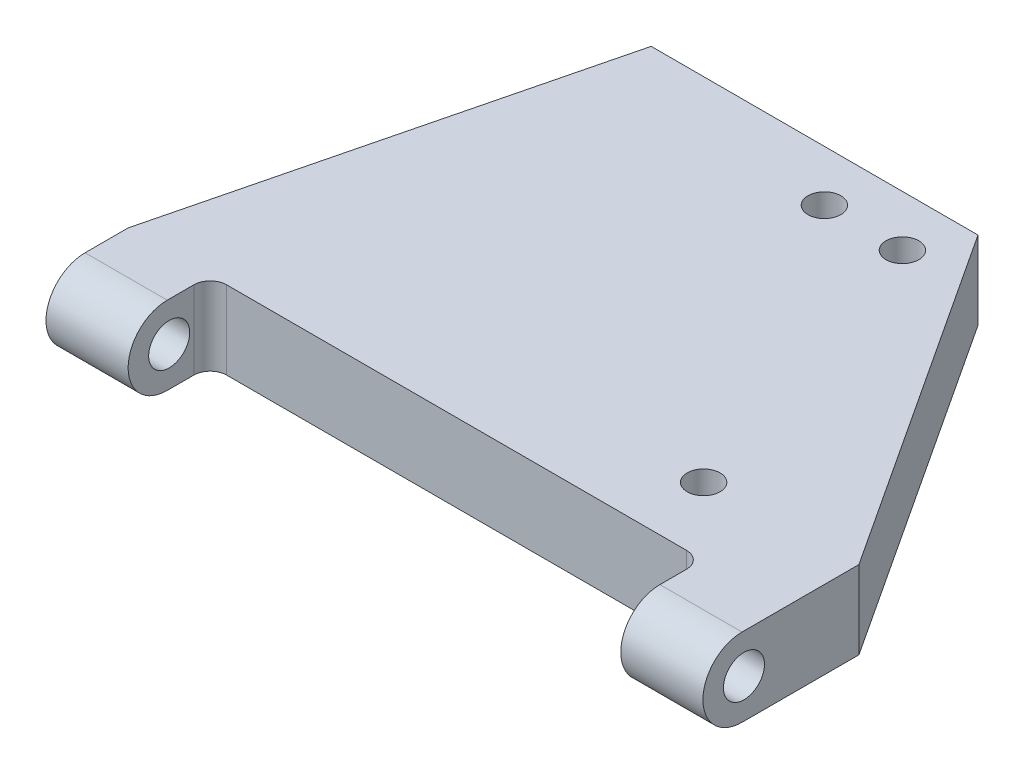
ISO-10303-21;
HEADER;
FILE_DESCRIPTION(('STEP AP214'),'2;1');
FILE_NAME('part.step','',(''),(''),'','','');
FILE_SCHEMA(('AUTOMOTIVE_DESIGN { 1 0 10303 214 1 1 1 1 }'));
ENDSEC;
DATA;
#1=APPLICATION_CONTEXT('core data for automotive mechanical design processes');
#2=APPLICATION_PROTOCOL_DEFINITION('international standard','automotive_design',2000,#1);
#3=PRODUCT_CONTEXT('',#1,'mechanical');
#4=PRODUCT('Part','Part','',(#3));
#5=PRODUCT_RELATED_PRODUCT_CATEGORY('part','',(#4));
#6=PRODUCT_DEFINITION_FORMATION('','',#4);
#7=PRODUCT_DEFINITION_CONTEXT('part definition',#1,'design');
#8=PRODUCT_DEFINITION('design','',#6,#7);
#9=PRODUCT_DEFINITION_SHAPE('','',#8);
#10=(LENGTH_UNIT() NAMED_UNIT(*) SI_UNIT(.MILLI.,.METRE.));
#11=(NAMED_UNIT(*) PLANE_ANGLE_UNIT() SI_UNIT($,.RADIAN.));
#12=(NAMED_UNIT(*) SI_UNIT($,.STERADIAN.) SOLID_ANGLE_UNIT());
#13=UNCERTAINTY_MEASURE_WITH_UNIT(LENGTH_MEASURE(1.E-05),#10,'distance_accuracy_value','');
#14=(GEOMETRIC_REPRESENTATION_CONTEXT(3) GLOBAL_UNCERTAINTY_ASSIGNED_CONTEXT((#13)) GLOBAL_UNIT_ASSIGNED_CONTEXT((#10,
#11,#12)) REPRESENTATION_CONTEXT('',''));
#15=CARTESIAN_POINT('',(0.,0.,0.));
#16=DIRECTION('',(0.,0.,1.));
#17=DIRECTION('',(1.,0.,0.));
#18=AXIS2_PLACEMENT_3D('',#15,#16,#17);
#19=CARTESIAN_POINT('',(140.,9.525,112.475));
#20=DIRECTION('',(1.,0.,0.));
#21=DIRECTION('',(0.,0.,-1.));
#22=AXIS2_PLACEMENT_3D('',#19,#20,#21);
#23=CYLINDRICAL_SURFACE('',#22,9.525);
#24=DIRECTION('',(-1.,0.,0.));
#25=VECTOR('',#24,1.);
#26=CARTESIAN_POINT('',(140.,19.05,112.475));
#27=LINE('',#26,#25);
#28=CARTESIAN_POINT('',(140.,19.05,112.475));
#29=VERTEX_POINT('',#28);
#30=CARTESIAN_POINT('',(160.,19.05,112.475));
#31=VERTEX_POINT('',#30);
#32=EDGE_CURVE('E293',#29,#31,#27,.F.);
#33=ORIENTED_EDGE('',*,*,#32,.F.);
#34=CARTESIAN_POINT('',(140.,9.525,112.475));
#35=DIRECTION('',(1.,0.,0.));
#36=DIRECTION('',(0.,0.,-1.));
#37=AXIS2_PLACEMENT_3D('',#34,#35,#36);
#38=CIRCLE('',#37,9.525);
#39=CARTESIAN_POINT('',(140.,0.,112.475));
#40=VERTEX_POINT('',#39);
#41=EDGE_CURVE('E118',#40,#29,#38,.F.);
#42=ORIENTED_EDGE('',*,*,#41,.F.);
#43=DIRECTION('',(1.,0.,0.));
#44=VECTOR('',#43,1.);
#45=CARTESIAN_POINT('',(0.,0.,112.475));
#46=LINE('',#45,#44);
#47=CARTESIAN_POINT('',(160.,0.,112.475));
#48=VERTEX_POINT('',#47);
#49=EDGE_CURVE('E296',#48,#40,#46,.F.);
#50=ORIENTED_EDGE('',*,*,#49,.F.);
#51=CARTESIAN_POINT('',(160.,9.525,112.475));
#52=DIRECTION('',(-1.,0.,0.));
#53=DIRECTION('',(0.,0.,1.));
#54=AXIS2_PLACEMENT_3D('',#51,#52,#53);
#55=CIRCLE('',#54,9.525);
#56=EDGE_CURVE('E12',#31,#48,#55,.F.);
#57=ORIENTED_EDGE('',*,*,#56,.F.);
#58=EDGE_LOOP('',(#33,#42,#50,#57));
#59=FACE_BOUND('',#58,.T.);
#60=ADVANCED_FACE('F110',(#59),#23,.T.);
#61=CARTESIAN_POINT('',(0.,9.525,112.475));
#62=DIRECTION('',(1.,0.,0.));
#63=DIRECTION('',(0.,0.,-1.));
#64=AXIS2_PLACEMENT_3D('',#61,#62,#63);
#65=CYLINDRICAL_SURFACE('',#64,9.525);
#66=DIRECTION('',(-1.,0.,0.));
#67=VECTOR('',#66,1.);
#68=CARTESIAN_POINT('',(0.,19.05,112.475));
#69=LINE('',#68,#67);
#70=CARTESIAN_POINT('',(0.,19.05,112.475));
#71=VERTEX_POINT('',#70);
#72=CARTESIAN_POINT('',(20.,19.05,112.475));
#73=VERTEX_POINT('',#72);
#74=EDGE_CURVE('E207',#71,#73,#69,.F.);
#75=ORIENTED_EDGE('',*,*,#74,.F.);
#76=CARTESIAN_POINT('',(0.,9.525,112.475));
#77=DIRECTION('',(1.,0.,0.));
#78=DIRECTION('',(0.,0.,-1.));
#79=AXIS2_PLACEMENT_3D('',#76,#77,#78);
#80=CIRCLE('',#79,9.525);
#81=CARTESIAN_POINT('',(0.,0.,112.475));
#82=VERTEX_POINT('',#81);
#83=EDGE_CURVE('E289',#82,#71,#80,.F.);
#84=ORIENTED_EDGE('',*,*,#83,.F.);
#85=DIRECTION('',(1.,0.,0.));
#86=VECTOR('',#85,1.);
#87=CARTESIAN_POINT('',(0.,0.,112.475));
#88=LINE('',#87,#86);
#89=CARTESIAN_POINT('',(20.,0.,112.475));
#90=VERTEX_POINT('',#89);
#91=EDGE_CURVE('E286',#90,#82,#88,.F.);
#92=ORIENTED_EDGE('',*,*,#91,.F.);
#93=CARTESIAN_POINT('',(20.,9.525,112.475));
#94=DIRECTION('',(1.,0.,0.));
#95=DIRECTION('',(0.,0.,-1.));
#96=AXIS2_PLACEMENT_3D('',#93,#94,#95);
#97=CIRCLE('',#96,9.525);
#98=EDGE_CURVE('E291',#73,#90,#97,.T.);
#99=ORIENTED_EDGE('',*,*,#98,.F.);
#100=EDGE_LOOP('',(#75,#84,#92,#99));
#101=FACE_BOUND('',#100,.T.);
#102=ADVANCED_FACE('F331',(#101),#65,.T.);
#103=CARTESIAN_POINT('',(0.,0.,0.));
#104=DIRECTION('',(0.,1.,0.));
#105=DIRECTION('',(0.,0.,1.));
#106=AXIS2_PLACEMENT_3D('',#103,#104,#105);
#107=PLANE('',#106);
#108=CARTESIAN_POINT('',(123.750569229122,0.,85.5773374277373));
#109=DIRECTION('',(0.,1.,0.));
#110=DIRECTION('',(0.,0.,1.));
#111=AXIS2_PLACEMENT_3D('',#108,#109,#110);
#112=CIRCLE('',#111,3.99999999999995);
#113=CARTESIAN_POINT('',(123.750569229122,0.,89.5773374277373));
#114=VERTEX_POINT('',#113);
#115=EDGE_CURVE('E436',#114,#114,#112,.T.);
#116=ORIENTED_EDGE('',*,*,#115,.T.);
#117=EDGE_LOOP('',(#116));
#118=FACE_BOUND('',#117,.T.);
#119=CARTESIAN_POINT('',(80.,0.,12.4141568321594));
#120=DIRECTION('',(0.,-1.,0.));
#121=DIRECTION('',(0.,0.,-1.));
#122=AXIS2_PLACEMENT_3D('',#119,#120,#121);
#123=CIRCLE('',#122,4.00000000000001);
#124=CARTESIAN_POINT('',(80.,0.,8.41415683215943));
#125=VERTEX_POINT('',#124);
#126=EDGE_CURVE('E445',#125,#125,#123,.T.);
#127=ORIENTED_EDGE('',*,*,#126,.F.);
#128=EDGE_LOOP('',(#127));
#129=FACE_BOUND('',#128,.T.);
#130=CARTESIAN_POINT('',(99.,0.,12.4141568321594));
#131=DIRECTION('',(0.,-1.,0.));
#132=DIRECTION('',(0.,0.,-1.));
#133=AXIS2_PLACEMENT_3D('',#130,#131,#132);
#134=CIRCLE('',#133,4.00000000000001);
#135=CARTESIAN_POINT('',(99.,0.,8.41415683215943));
#136=VERTEX_POINT('',#135);
#137=EDGE_CURVE('E395',#136,#136,#134,.T.);
#138=ORIENTED_EDGE('',*,*,#137,.F.);
#139=EDGE_LOOP('',(#138));
#140=FACE_BOUND('',#139,.T.);
#141=DIRECTION('',(0.,0.,-1.));
#142=VECTOR('',#141,1.);
#143=CARTESIAN_POINT('',(160.,0.,1.1686558153949E-13));
#144=LINE('',#143,#142);
#145=CARTESIAN_POINT('',(160.,0.,84.));
#146=VERTEX_POINT('',#145);
#147=EDGE_CURVE('E255',#48,#146,#144,.T.);
#148=ORIENTED_EDGE('',*,*,#147,.F.);
#149=ORIENTED_EDGE('',*,*,#49,.T.);
#150=DIRECTION('',(0.,0.,1.));
#151=VECTOR('',#150,1.);
#152=CARTESIAN_POINT('',(140.,0.,2.42861286636753E-13));
#153=LINE('',#152,#151);
#154=CARTESIAN_POINT('',(140.,0.,106.));
#155=VERTEX_POINT('',#154);
#156=EDGE_CURVE('E252',#155,#40,#153,.T.);
#157=ORIENTED_EDGE('',*,*,#156,.F.);
#158=CARTESIAN_POINT('',(136.,0.,106.));
#159=DIRECTION('',(0.,1.,0.));
#160=DIRECTION('',(0.,0.,1.));
#161=AXIS2_PLACEMENT_3D('',#158,#159,#160);
#162=CIRCLE('',#161,4.00000000000001);
#163=CARTESIAN_POINT('',(136.,0.,102.));
#164=VERTEX_POINT('',#163);
#165=EDGE_CURVE('E249',#164,#155,#162,.F.);
#166=ORIENTED_EDGE('',*,*,#165,.F.);
#167=DIRECTION('',(-1.,0.,0.));
#168=VECTOR('',#167,1.);
#169=CARTESIAN_POINT('',(0.,0.,102.));
#170=LINE('',#169,#168);
#171=CARTESIAN_POINT('',(24.,0.,102.));
#172=VERTEX_POINT('',#171);
#173=EDGE_CURVE('E246',#164,#172,#170,.T.);
#174=ORIENTED_EDGE('',*,*,#173,.T.);
#175=CARTESIAN_POINT('',(24.,0.,106.));
#176=DIRECTION('',(0.,1.,0.));
#177=DIRECTION('',(0.,0.,1.));
#178=AXIS2_PLACEMENT_3D('',#175,#176,#177);
#179=CIRCLE('',#178,4.00000000000001);
#180=CARTESIAN_POINT('',(20.,0.,106.));
#181=VERTEX_POINT('',#180);
#182=EDGE_CURVE('E202',#172,#181,#179,.T.);
#183=ORIENTED_EDGE('',*,*,#182,.T.);
#184=DIRECTION('',(0.,0.,1.));
#185=VECTOR('',#184,1.);
#186=CARTESIAN_POINT('',(20.,0.,0.));
#187=LINE('',#186,#185);
#188=EDGE_CURVE('E219',#181,#90,#187,.T.);
#189=ORIENTED_EDGE('',*,*,#188,.T.);
#190=ORIENTED_EDGE('',*,*,#91,.T.);
#191=DIRECTION('',(0.,0.,1.));
#192=VECTOR('',#191,1.);
#193=CARTESIAN_POINT('',(0.,0.,0.));
#194=LINE('',#193,#192);
#195=CARTESIAN_POINT('',(0.,0.,102.));
#196=VERTEX_POINT('',#195);
#197=EDGE_CURVE('E266',#196,#82,#194,.T.);
#198=ORIENTED_EDGE('',*,*,#197,.F.);
#199=DIRECTION('',(0.241640143717287,0.,-0.97036593146312));
#200=VECTOR('',#199,1.);
#201=CARTESIAN_POINT('',(23.9168950399849,0.,5.95577582368252));
#202=LINE('',#201,#200);
#203=CARTESIAN_POINT('',(25.4,0.,0.));
#204=VERTEX_POINT('',#203);
#205=EDGE_CURVE('E263',#196,#204,#202,.T.);
#206=ORIENTED_EDGE('',*,*,#205,.T.);
#207=DIRECTION('',(-1.,0.,0.));
#208=VECTOR('',#207,1.);
#209=CARTESIAN_POINT('',(0.,0.,0.));
#210=LINE('',#209,#208);
#211=CARTESIAN_POINT('',(105.,0.,0.));
#212=VERTEX_POINT('',#211);
#213=EDGE_CURVE('E260',#212,#204,#210,.T.);
#214=ORIENTED_EDGE('',*,*,#213,.F.);
#215=DIRECTION('',(0.547785941363776,0.,0.836618528628312));
#216=VECTOR('',#215,1.);
#217=CARTESIAN_POINT('',(73.4927090566412,0.,-48.1202261680389));
#218=LINE('',#217,#216);
#219=EDGE_CURVE('E257',#212,#146,#218,.T.);
#220=ORIENTED_EDGE('',*,*,#219,.T.);
#221=EDGE_LOOP('',(#148,#149,#157,#166,#174,#183,#189,#190,#198,#206,#214,#220));
#222=FACE_BOUND('',#221,.T.);
#223=ADVANCED_FACE('F305',(#118,#129,#140,#222),#107,.F.);
#224=CARTESIAN_POINT('',(140.,19.05,2.42861286636753E-13));
#225=DIRECTION('',(1.,0.,0.));
#226=DIRECTION('',(0.,0.,-1.));
#227=AXIS2_PLACEMENT_3D('',#224,#225,#226);
#228=PLANE('',#227);
#229=CARTESIAN_POINT('',(140.,9.525,112.));
#230=DIRECTION('',(1.,0.,0.));
#231=DIRECTION('',(0.,0.,-1.));
#232=AXIS2_PLACEMENT_3D('',#229,#230,#231);
#233=CIRCLE('',#232,5.);
#234=CARTESIAN_POINT('',(140.,9.525,107.));
#235=VERTEX_POINT('',#234);
#236=EDGE_CURVE('E389',#235,#235,#233,.T.);
#237=ORIENTED_EDGE('',*,*,#236,.T.);
#238=EDGE_LOOP('',(#237));
#239=FACE_BOUND('',#238,.T.);
#240=ORIENTED_EDGE('',*,*,#156,.T.);
#241=ORIENTED_EDGE('',*,*,#41,.T.);
#242=DIRECTION('',(0.,0.,1.));
#243=VECTOR('',#242,1.);
#244=CARTESIAN_POINT('',(140.,19.05,2.42861286636753E-13));
#245=LINE('',#244,#243);
#246=CARTESIAN_POINT('',(140.,19.05,106.));
#247=VERTEX_POINT('',#246);
#248=EDGE_CURVE('E225',#247,#29,#245,.T.);
#249=ORIENTED_EDGE('',*,*,#248,.F.);
#250=DIRECTION('',(0.,-1.,0.));
#251=VECTOR('',#250,1.);
#252=CARTESIAN_POINT('',(140.,19.05,106.));
#253=LINE('',#252,#251);
#254=EDGE_CURVE('E281',#247,#155,#253,.T.);
#255=ORIENTED_EDGE('',*,*,#254,.T.);
#256=EDGE_LOOP('',(#240,#241,#249,#255));
#257=FACE_BOUND('',#256,.T.);
#258=ADVANCED_FACE('F298',(#239,#257),#228,.F.);
#259=CARTESIAN_POINT('',(136.,19.05,106.));
#260=DIRECTION('',(0.,-1.,0.));
#261=DIRECTION('',(0.,0.,-1.));
#262=AXIS2_PLACEMENT_3D('',#259,#260,#261);
#263=CYLINDRICAL_SURFACE('',#262,4.00000000000001);
#264=ORIENTED_EDGE('',*,*,#165,.T.);
#265=ORIENTED_EDGE('',*,*,#254,.F.);
#266=CARTESIAN_POINT('',(136.,19.05,106.));
#267=DIRECTION('',(0.,1.,0.));
#268=DIRECTION('',(0.,0.,1.));
#269=AXIS2_PLACEMENT_3D('',#266,#267,#268);
#270=CIRCLE('',#269,4.00000000000001);
#271=CARTESIAN_POINT('',(136.,19.05,102.));
#272=VERTEX_POINT('',#271);
#273=EDGE_CURVE('E223',#272,#247,#270,.F.);
#274=ORIENTED_EDGE('',*,*,#273,.F.);
#275=DIRECTION('',(0.,-1.,0.));
#276=VECTOR('',#275,1.);
#277=CARTESIAN_POINT('',(136.,19.05,102.));
#278=LINE('',#277,#276);
#279=EDGE_CURVE('E208',#272,#164,#278,.T.);
#280=ORIENTED_EDGE('',*,*,#279,.T.);
#281=EDGE_LOOP('',(#264,#265,#274,#280));
#282=FACE_BOUND('',#281,.T.);
#283=ADVANCED_FACE('F301',(#282),#263,.F.);
#284=CARTESIAN_POINT('',(0.,19.05,102.));
#285=DIRECTION('',(0.,0.,1.));
#286=DIRECTION('',(1.,0.,0.));
#287=AXIS2_PLACEMENT_3D('',#284,#285,#286);
#288=PLANE('',#287);
#289=ORIENTED_EDGE('',*,*,#173,.F.);
#290=ORIENTED_EDGE('',*,*,#279,.F.);
#291=DIRECTION('',(-1.,0.,0.));
#292=VECTOR('',#291,1.);
#293=CARTESIAN_POINT('',(0.,19.05,102.));
#294=LINE('',#293,#292);
#295=CARTESIAN_POINT('',(24.,19.05,102.));
#296=VERTEX_POINT('',#295);
#297=EDGE_CURVE('E215',#272,#296,#294,.T.);
#298=ORIENTED_EDGE('',*,*,#297,.T.);
#299=DIRECTION('',(0.,-1.,0.));
#300=VECTOR('',#299,1.);
#301=CARTESIAN_POINT('',(24.,19.05,102.));
#302=LINE('',#301,#300);
#303=EDGE_CURVE('E196',#296,#172,#302,.T.);
#304=ORIENTED_EDGE('',*,*,#303,.T.);
#305=EDGE_LOOP('',(#289,#290,#298,#304));
#306=FACE_BOUND('',#305,.T.);
#307=ADVANCED_FACE('F221',(#306),#288,.T.);
#308=CARTESIAN_POINT('',(24.,19.05,106.));
#309=DIRECTION('',(0.,-1.,0.));
#310=DIRECTION('',(0.,0.,-1.));
#311=AXIS2_PLACEMENT_3D('',#308,#309,#310);
#312=CYLINDRICAL_SURFACE('',#311,4.00000000000001);
#313=ORIENTED_EDGE('',*,*,#182,.F.);
#314=ORIENTED_EDGE('',*,*,#303,.F.);
#315=CARTESIAN_POINT('',(24.,19.05,106.));
#316=DIRECTION('',(0.,1.,0.));
#317=DIRECTION('',(0.,0.,1.));
#318=AXIS2_PLACEMENT_3D('',#315,#316,#317);
#319=CIRCLE('',#318,4.00000000000001);
#320=CARTESIAN_POINT('',(20.,19.05,106.));
#321=VERTEX_POINT('',#320);
#322=EDGE_CURVE('E199',#296,#321,#319,.T.);
#323=ORIENTED_EDGE('',*,*,#322,.T.);
#324=DIRECTION('',(0.,-1.,0.));
#325=VECTOR('',#324,1.);
#326=CARTESIAN_POINT('',(20.,19.05,106.));
#327=LINE('',#326,#325);
#328=EDGE_CURVE('E244',#321,#181,#327,.T.);
#329=ORIENTED_EDGE('',*,*,#328,.T.);
#330=EDGE_LOOP('',(#313,#314,#323,#329));
#331=FACE_BOUND('',#330,.T.);
#332=ADVANCED_FACE('F198',(#331),#312,.F.);
#333=CARTESIAN_POINT('',(20.,19.05,0.));
#334=DIRECTION('',(1.,0.,0.));
#335=DIRECTION('',(0.,0.,-1.));
#336=AXIS2_PLACEMENT_3D('',#333,#334,#335);
#337=PLANE('',#336);
#338=CARTESIAN_POINT('',(20.,9.525,112.));
#339=DIRECTION('',(1.,0.,0.));
#340=DIRECTION('',(0.,0.,-1.));
#341=AXIS2_PLACEMENT_3D('',#338,#339,#340);
#342=CIRCLE('',#341,5.);
#343=CARTESIAN_POINT('',(20.,9.525,107.));
#344=VERTEX_POINT('',#343);
#345=EDGE_CURVE('E385',#344,#344,#342,.T.);
#346=ORIENTED_EDGE('',*,*,#345,.F.);
#347=EDGE_LOOP('',(#346));
#348=FACE_BOUND('',#347,.T.);
#349=DIRECTION('',(0.,0.,1.));
#350=VECTOR('',#349,1.);
#351=CARTESIAN_POINT('',(20.,19.05,0.));
#352=LINE('',#351,#350);
#353=EDGE_CURVE('E218',#321,#73,#352,.T.);
#354=ORIENTED_EDGE('',*,*,#353,.T.);
#355=ORIENTED_EDGE('',*,*,#98,.T.);
#356=ORIENTED_EDGE('',*,*,#188,.F.);
#357=ORIENTED_EDGE('',*,*,#328,.F.);
#358=EDGE_LOOP('',(#354,#355,#356,#357));
#359=FACE_BOUND('',#358,.T.);
#360=ADVANCED_FACE('F328',(#348,#359),#337,.T.);
#361=CARTESIAN_POINT('',(0.,19.05,0.));
#362=DIRECTION('',(1.,0.,0.));
#363=DIRECTION('',(0.,0.,-1.));
#364=AXIS2_PLACEMENT_3D('',#361,#362,#363);
#365=PLANE('',#364);
#366=CARTESIAN_POINT('',(0.,9.525,112.));
#367=DIRECTION('',(-1.,0.,0.));
#368=DIRECTION('',(0.,0.,1.));
#369=AXIS2_PLACEMENT_3D('',#366,#367,#368);
#370=CIRCLE('',#369,5.);
#371=CARTESIAN_POINT('',(0.,9.525,117.));
#372=VERTEX_POINT('',#371);
#373=EDGE_CURVE('E386',#372,#372,#370,.T.);
#374=ORIENTED_EDGE('',*,*,#373,.F.);
#375=EDGE_LOOP('',(#374));
#376=FACE_BOUND('',#375,.T.);
#377=ORIENTED_EDGE('',*,*,#197,.T.);
#378=ORIENTED_EDGE('',*,*,#83,.T.);
#379=DIRECTION('',(0.,0.,1.));
#380=VECTOR('',#379,1.);
#381=CARTESIAN_POINT('',(0.,19.05,0.));
#382=LINE('',#381,#380);
#383=CARTESIAN_POINT('',(0.,19.05,102.));
#384=VERTEX_POINT('',#383);
#385=EDGE_CURVE('E240',#384,#71,#382,.T.);
#386=ORIENTED_EDGE('',*,*,#385,.F.);
#387=DIRECTION('',(0.,-1.,0.));
#388=VECTOR('',#387,1.);
#389=CARTESIAN_POINT('',(0.,19.05,102.));
#390=LINE('',#389,#388);
#391=EDGE_CURVE('E272',#384,#196,#390,.T.);
#392=ORIENTED_EDGE('',*,*,#391,.T.);
#393=EDGE_LOOP('',(#377,#378,#386,#392));
#394=FACE_BOUND('',#393,.T.);
#395=ADVANCED_FACE('F324',(#376,#394),#365,.F.);
#396=CARTESIAN_POINT('',(23.9168950399849,19.05,5.95577582368252));
#397=DIRECTION('',(-0.97036593146312,0.,-0.241640143717287));
#398=DIRECTION('',(-0.241640143717287,0.,0.97036593146312));
#399=AXIS2_PLACEMENT_3D('',#396,#397,#398);
#400=PLANE('',#399);
#401=ORIENTED_EDGE('',*,*,#205,.F.);
#402=ORIENTED_EDGE('',*,*,#391,.F.);
#403=DIRECTION('',(0.241640143717287,0.,-0.97036593146312));
#404=VECTOR('',#403,1.);
#405=CARTESIAN_POINT('',(23.9168950399849,19.05,5.95577582368252));
#406=LINE('',#405,#404);
#407=CARTESIAN_POINT('',(25.4,19.05,0.));
#408=VERTEX_POINT('',#407);
#409=EDGE_CURVE('E237',#384,#408,#406,.T.);
#410=ORIENTED_EDGE('',*,*,#409,.T.);
#411=DIRECTION('',(0.,-1.,0.));
#412=VECTOR('',#411,1.);
#413=CARTESIAN_POINT('',(25.4,19.05,0.));
#414=LINE('',#413,#412);
#415=EDGE_CURVE('E274',#408,#204,#414,.T.);
#416=ORIENTED_EDGE('',*,*,#415,.T.);
#417=EDGE_LOOP('',(#401,#402,#410,#416));
#418=FACE_BOUND('',#417,.T.);
#419=ADVANCED_FACE('F320',(#418),#400,.T.);
#420=CARTESIAN_POINT('',(0.,19.05,0.));
#421=DIRECTION('',(0.,0.,1.));
#422=DIRECTION('',(1.,0.,0.));
#423=AXIS2_PLACEMENT_3D('',#420,#421,#422);
#424=PLANE('',#423);
#425=CARTESIAN_POINT('',(34.925,9.525,0.));
#426=DIRECTION('',(0.,0.,-1.));
#427=DIRECTION('',(-1.,0.,0.));
#428=AXIS2_PLACEMENT_3D('',#425,#426,#427);
#429=CIRCLE('',#428,3.96875);
#430=CARTESIAN_POINT('',(30.95625,9.525,0.));
#431=VERTEX_POINT('',#430);
#432=EDGE_CURVE('E399',#431,#431,#429,.T.);
#433=ORIENTED_EDGE('',*,*,#432,.F.);
#434=EDGE_LOOP('',(#433));
#435=FACE_BOUND('',#434,.T.);
#436=ORIENTED_EDGE('',*,*,#213,.T.);
#437=ORIENTED_EDGE('',*,*,#415,.F.);
#438=DIRECTION('',(-1.,0.,0.));
#439=VECTOR('',#438,1.);
#440=CARTESIAN_POINT('',(0.,19.05,0.));
#441=LINE('',#440,#439);
#442=CARTESIAN_POINT('',(105.,19.05,0.));
#443=VERTEX_POINT('',#442);
#444=EDGE_CURVE('E235',#443,#408,#441,.T.);
#445=ORIENTED_EDGE('',*,*,#444,.F.);
#446=DIRECTION('',(0.,-1.,0.));
#447=VECTOR('',#446,1.);
#448=CARTESIAN_POINT('',(105.,19.05,0.));
#449=LINE('',#448,#447);
#450=EDGE_CURVE('E276',#443,#212,#449,.T.);
#451=ORIENTED_EDGE('',*,*,#450,.T.);
#452=EDGE_LOOP('',(#436,#437,#445,#451));
#453=FACE_BOUND('',#452,.T.);
#454=ADVANCED_FACE('F317',(#435,#453),#424,.F.);
#455=CARTESIAN_POINT('',(73.4927090566412,19.05,-48.1202261680389));
#456=DIRECTION('',(0.836618528628312,0.,-0.547785941363776));
#457=DIRECTION('',(-0.547785941363776,0.,-0.836618528628312));
#458=AXIS2_PLACEMENT_3D('',#455,#456,#457);
#459=PLANE('',#458);
#460=ORIENTED_EDGE('',*,*,#219,.F.);
#461=ORIENTED_EDGE('',*,*,#450,.F.);
#462=DIRECTION('',(0.547785941363776,0.,0.836618528628312));
#463=VECTOR('',#462,1.);
#464=CARTESIAN_POINT('',(73.4927090566412,19.05,-48.1202261680389));
#465=LINE('',#464,#463);
#466=CARTESIAN_POINT('',(160.,19.05,84.));
#467=VERTEX_POINT('',#466);
#468=EDGE_CURVE('E232',#443,#467,#465,.T.);
#469=ORIENTED_EDGE('',*,*,#468,.T.);
#470=DIRECTION('',(0.,-1.,0.));
#471=VECTOR('',#470,1.);
#472=CARTESIAN_POINT('',(160.,19.05,84.));
#473=LINE('',#472,#471);
#474=EDGE_CURVE('E278',#467,#146,#473,.T.);
#475=ORIENTED_EDGE('',*,*,#474,.T.);
#476=EDGE_LOOP('',(#460,#461,#469,#475));
#477=FACE_BOUND('',#476,.T.);
#478=ADVANCED_FACE('F311',(#477),#459,.T.);
#479=CARTESIAN_POINT('',(160.,19.05,1.1686558153949E-13));
#480=DIRECTION('',(-1.,0.,0.));
#481=DIRECTION('',(0.,0.,1.));
#482=AXIS2_PLACEMENT_3D('',#479,#480,#481);
#483=PLANE('',#482);
#484=CARTESIAN_POINT('',(160.,9.525,112.));
#485=DIRECTION('',(-1.,0.,0.));
#486=DIRECTION('',(0.,0.,1.));
#487=AXIS2_PLACEMENT_3D('',#484,#485,#486);
#488=CIRCLE('',#487,5.);
#489=CARTESIAN_POINT('',(160.,9.525,117.));
#490=VERTEX_POINT('',#489);
#491=EDGE_CURVE('E383',#490,#490,#488,.T.);
#492=ORIENTED_EDGE('',*,*,#491,.T.);
#493=EDGE_LOOP('',(#492));
#494=FACE_BOUND('',#493,.T.);
#495=DIRECTION('',(0.,0.,-1.));
#496=VECTOR('',#495,1.);
#497=CARTESIAN_POINT('',(160.,19.05,1.1686558153949E-13));
#498=LINE('',#497,#496);
#499=EDGE_CURVE('E230',#31,#467,#498,.T.);
#500=ORIENTED_EDGE('',*,*,#499,.F.);
#501=ORIENTED_EDGE('',*,*,#56,.T.);
#502=ORIENTED_EDGE('',*,*,#147,.T.);
#503=ORIENTED_EDGE('',*,*,#474,.F.);
#504=EDGE_LOOP('',(#500,#501,#502,#503));
#505=FACE_BOUND('',#504,.T.);
#506=ADVANCED_FACE('F309',(#494,#505),#483,.F.);
#507=CARTESIAN_POINT('',(0.,19.05,0.));
#508=DIRECTION('',(0.,1.,0.));
#509=DIRECTION('',(0.,0.,1.));
#510=AXIS2_PLACEMENT_3D('',#507,#508,#509);
#511=PLANE('',#510);
#512=CARTESIAN_POINT('',(123.750569229122,19.05,85.5773374277373));
#513=DIRECTION('',(0.,1.,0.));
#514=DIRECTION('',(0.,0.,1.));
#515=AXIS2_PLACEMENT_3D('',#512,#513,#514);
#516=CIRCLE('',#515,3.99999999999995);
#517=CARTESIAN_POINT('',(123.750569229122,19.05,89.5773374277373));
#518=VERTEX_POINT('',#517);
#519=EDGE_CURVE('E439',#518,#518,#516,.T.);
#520=ORIENTED_EDGE('',*,*,#519,.F.);
#521=EDGE_LOOP('',(#520));
#522=FACE_BOUND('',#521,.T.);
#523=CARTESIAN_POINT('',(80.,19.05,12.4141568321594));
#524=DIRECTION('',(0.,-1.,0.));
#525=DIRECTION('',(0.,0.,-1.));
#526=AXIS2_PLACEMENT_3D('',#523,#524,#525);
#527=CIRCLE('',#526,4.00000000000001);
#528=CARTESIAN_POINT('',(80.,19.05,8.41415683215943));
#529=VERTEX_POINT('',#528);
#530=EDGE_CURVE('E392',#529,#529,#527,.T.);
#531=ORIENTED_EDGE('',*,*,#530,.T.);
#532=EDGE_LOOP('',(#531));
#533=FACE_BOUND('',#532,.T.);
#534=CARTESIAN_POINT('',(99.,19.05,12.4141568321594));
#535=DIRECTION('',(0.,-1.,0.));
#536=DIRECTION('',(0.,0.,-1.));
#537=AXIS2_PLACEMENT_3D('',#534,#535,#536);
#538=CIRCLE('',#537,4.00000000000001);
#539=CARTESIAN_POINT('',(99.,19.05,8.41415683215943));
#540=VERTEX_POINT('',#539);
#541=EDGE_CURVE('E447',#540,#540,#538,.T.);
#542=ORIENTED_EDGE('',*,*,#541,.T.);
#543=EDGE_LOOP('',(#542));
#544=FACE_BOUND('',#543,.T.);
#545=ORIENTED_EDGE('',*,*,#248,.T.);
#546=ORIENTED_EDGE('',*,*,#32,.T.);
#547=ORIENTED_EDGE('',*,*,#499,.T.);
#548=ORIENTED_EDGE('',*,*,#468,.F.);
#549=ORIENTED_EDGE('',*,*,#444,.T.);
#550=ORIENTED_EDGE('',*,*,#409,.F.);
#551=ORIENTED_EDGE('',*,*,#385,.T.);
#552=ORIENTED_EDGE('',*,*,#74,.T.);
#553=ORIENTED_EDGE('',*,*,#353,.F.);
#554=ORIENTED_EDGE('',*,*,#322,.F.);
#555=ORIENTED_EDGE('',*,*,#297,.F.);
#556=ORIENTED_EDGE('',*,*,#273,.T.);
#557=EDGE_LOOP('',(#545,#546,#547,#548,#549,#550,#551,#552,#553,#554,#555,#556));
#558=FACE_BOUND('',#557,.T.);
#559=ADVANCED_FACE('F213',(#522,#533,#544,#558),#511,.T.);
#560=CARTESIAN_POINT('',(34.925,9.525,38.1));
#561=DIRECTION('',(0.,0.,-1.));
#562=DIRECTION('',(-1.,0.,0.));
#563=AXIS2_PLACEMENT_3D('',#560,#561,#562);
#564=CYLINDRICAL_SURFACE('',#563,3.96875);
#565=CARTESIAN_POINT('',(34.925,9.525,38.1));
#566=DIRECTION('',(0.,0.,-1.));
#567=DIRECTION('',(-1.,0.,0.));
#568=AXIS2_PLACEMENT_3D('',#565,#566,#567);
#569=CIRCLE('',#568,3.96875);
#570=CARTESIAN_POINT('',(30.95625,9.525,38.1));
#571=VERTEX_POINT('',#570);
#572=EDGE_CURVE('E247',#571,#571,#569,.T.);
#573=CARTESIAN_POINT('',(30.95625,9.525,38.1));
#574=CARTESIAN_POINT('',(30.95625,9.525,37.703125));
#575=CARTESIAN_POINT('',(30.95625,9.525,37.30625));
#576=CARTESIAN_POINT('',(30.95625,9.525,36.5125));
#577=CARTESIAN_POINT('',(30.95625,9.525,36.115625));
#578=CARTESIAN_POINT('',(30.95625,9.525,35.321875));
#579=CARTESIAN_POINT('',(30.95625,9.525,34.925));
#580=CARTESIAN_POINT('',(30.95625,9.525,34.13125));
#581=CARTESIAN_POINT('',(30.95625,9.525,33.734375));
#582=CARTESIAN_POINT('',(30.95625,9.525,32.940625));
#583=CARTESIAN_POINT('',(30.95625,9.525,32.54375));
#584=CARTESIAN_POINT('',(30.95625,9.525,31.75));
#585=CARTESIAN_POINT('',(30.95625,9.525,31.353125));
#586=CARTESIAN_POINT('',(30.95625,9.525,30.559375));
#587=CARTESIAN_POINT('',(30.95625,9.525,30.1625));
#588=CARTESIAN_POINT('',(30.95625,9.525,29.36875));
#589=CARTESIAN_POINT('',(30.95625,9.525,28.971875));
#590=CARTESIAN_POINT('',(30.95625,9.525,28.178125));
#591=CARTESIAN_POINT('',(30.95625,9.525,27.78125));
#592=CARTESIAN_POINT('',(30.95625,9.525,26.9875));
#593=CARTESIAN_POINT('',(30.95625,9.525,26.590625));
#594=CARTESIAN_POINT('',(30.95625,9.525,25.796875));
#595=CARTESIAN_POINT('',(30.95625,9.525,25.4));
#596=CARTESIAN_POINT('',(30.95625,9.525,24.60625));
#597=CARTESIAN_POINT('',(30.95625,9.525,24.209375));
#598=CARTESIAN_POINT('',(30.95625,9.525,23.415625));
#599=CARTESIAN_POINT('',(30.95625,9.525,23.01875));
#600=CARTESIAN_POINT('',(30.95625,9.525,22.225));
#601=CARTESIAN_POINT('',(30.95625,9.525,21.828125));
#602=CARTESIAN_POINT('',(30.95625,9.525,21.034375));
#603=CARTESIAN_POINT('',(30.95625,9.525,20.6375));
#604=CARTESIAN_POINT('',(30.95625,9.525,19.84375));
#605=CARTESIAN_POINT('',(30.95625,9.525,19.446875));
#606=CARTESIAN_POINT('',(30.95625,9.525,18.653125));
#607=CARTESIAN_POINT('',(30.95625,9.525,18.25625));
#608=CARTESIAN_POINT('',(30.95625,9.525,17.4625));
#609=CARTESIAN_POINT('',(30.95625,9.525,17.065625));
#610=CARTESIAN_POINT('',(30.95625,9.525,16.271875));
#611=CARTESIAN_POINT('',(30.95625,9.525,15.875));
#612=CARTESIAN_POINT('',(30.95625,9.525,15.08125));
#613=CARTESIAN_POINT('',(30.95625,9.525,14.684375));
#614=CARTESIAN_POINT('',(30.95625,9.525,13.890625));
#615=CARTESIAN_POINT('',(30.95625,9.525,13.49375));
#616=CARTESIAN_POINT('',(30.95625,9.525,12.7));
#617=CARTESIAN_POINT('',(30.95625,9.525,12.303125));
#618=CARTESIAN_POINT('',(30.95625,9.525,11.509375));
#619=CARTESIAN_POINT('',(30.95625,9.525,11.1125));
#620=CARTESIAN_POINT('',(30.95625,9.525,10.31875));
#621=CARTESIAN_POINT('',(30.95625,9.525,9.92187499999999));
#622=CARTESIAN_POINT('',(30.95625,9.525,9.128125));
#623=CARTESIAN_POINT('',(30.95625,9.525,8.73124999999999));
#624=CARTESIAN_POINT('',(30.95625,9.525,7.93749999999999));
#625=CARTESIAN_POINT('',(30.95625,9.525,7.54062499999999));
#626=CARTESIAN_POINT('',(30.95625,9.525,6.74687499999999));
#627=CARTESIAN_POINT('',(30.95625,9.525,6.35));
#628=CARTESIAN_POINT('',(30.95625,9.525,5.55625));
#629=CARTESIAN_POINT('',(30.95625,9.525,5.159375));
#630=CARTESIAN_POINT('',(30.95625,9.525,4.365625));
#631=CARTESIAN_POINT('',(30.95625,9.525,3.96875));
#632=CARTESIAN_POINT('',(30.95625,9.525,3.17499999999999));
#633=CARTESIAN_POINT('',(30.95625,9.525,2.77812499999999));
#634=CARTESIAN_POINT('',(30.95625,9.525,1.98437499999999));
#635=CARTESIAN_POINT('',(30.95625,9.525,1.58749999999999));
#636=CARTESIAN_POINT('',(30.95625,9.525,0.793749999999994));
#637=CARTESIAN_POINT('',(30.95625,9.525,0.396874999999993));
#638=CARTESIAN_POINT('',(30.95625,9.525,0.));
#639=B_SPLINE_CURVE_WITH_KNOTS('',3,(#573,#574,#575,#576,#577,#578,#579,#580,#581,#582,#583,
#584,#585,#586,#587,#588,#589,#590,#591,#592,#593,#594,#595,#596,#597,#598,#599,#600,#601,#602,
#603,#604,#605,#606,#607,#608,#609,#610,#611,#612,#613,#614,#615,#616,#617,#618,#619,#620,#621,
#622,#623,#624,#625,#626,#627,#628,#629,#630,#631,#632,#633,#634,#635,#636,#637,#638),
.UNSPECIFIED.,.F.,.F.,(4,2,2,2,2,2,2,2,2,2,2,2,2,2,2,2,2,2,2,2,2,2,2,2,2,2,2,2,2,2,2,2,4),(0.,
1.19062499999999,2.38124999999999,3.571875,4.7625,5.953125,7.14375,8.334375,9.525,10.715625,
11.90625,13.096875,14.2875,15.478125,16.66875,17.859375,19.05,20.240625,21.43125,22.621875,
23.8125,25.003125,26.19375,27.384375,28.575,29.765625,30.95625,32.146875,33.3375,34.528125,
35.71875,36.909375,38.1),.UNSPECIFIED.);
#640=EDGE_CURVE('BSEAM379',#571,#431,#639,.T.);
#641=ORIENTED_EDGE('',*,*,#572,.F.);
#642=ORIENTED_EDGE('',*,*,#432,.T.);
#643=ORIENTED_EDGE('',*,*,#640,.T.);
#644=ORIENTED_EDGE('',*,*,#640,.F.);
#645=EDGE_LOOP('',(#641,#643,#642,#644));
#646=FACE_BOUND('',#645,.T.);
#647=ADVANCED_FACE('F379',(#646),#564,.F.);
#648=CARTESIAN_POINT('',(34.925,9.525,38.1));
#649=DIRECTION('',(0.,0.,-1.));
#650=DIRECTION('',(-1.,0.,0.));
#651=AXIS2_PLACEMENT_3D('',#648,#649,#650);
#652=PLANE('',#651);
#653=ORIENTED_EDGE('',*,*,#572,.T.);
#654=EDGE_LOOP('',(#653));
#655=FACE_BOUND('',#654,.T.);
#656=ADVANCED_FACE('F405',(#655),#652,.T.);
#657=CARTESIAN_POINT('',(160.,9.525,112.));
#658=DIRECTION('',(-1.,0.,0.));
#659=DIRECTION('',(0.,0.,1.));
#660=AXIS2_PLACEMENT_3D('',#657,#658,#659);
#661=CYLINDRICAL_SURFACE('',#660,5.);
#662=ORIENTED_EDGE('',*,*,#491,.F.);
#663=EDGE_LOOP('',(#662));
#664=FACE_BOUND('',#663,.T.);
#665=ORIENTED_EDGE('',*,*,#236,.F.);
#666=EDGE_LOOP('',(#665));
#667=FACE_BOUND('',#666,.T.);
#668=ADVANCED_FACE('F411',(#664,#667),#661,.F.);
#669=ORIENTED_EDGE('',*,*,#345,.T.);
#670=EDGE_LOOP('',(#669));
#671=FACE_BOUND('',#670,.T.);
#672=ORIENTED_EDGE('',*,*,#373,.T.);
#673=EDGE_LOOP('',(#672));
#674=FACE_BOUND('',#673,.T.);
#675=ADVANCED_FACE('F416',(#671,#674),#661,.F.);
#676=CARTESIAN_POINT('',(99.,19.05,12.4141568321594));
#677=DIRECTION('',(0.,-1.,0.));
#678=DIRECTION('',(0.,0.,-1.));
#679=AXIS2_PLACEMENT_3D('',#676,#677,#678);
#680=CYLINDRICAL_SURFACE('',#679,4.00000000000001);
#681=CARTESIAN_POINT('',(99.,19.05,8.41415683215943));
#682=CARTESIAN_POINT('',(99.,18.8515625,8.41415683215943));
#683=CARTESIAN_POINT('',(99.,18.653125,8.41415683215943));
#684=CARTESIAN_POINT('',(99.,18.25625,8.41415683215943));
#685=CARTESIAN_POINT('',(99.,18.0578125,8.41415683215943));
#686=CARTESIAN_POINT('',(99.,17.6609375,8.41415683215943));
#687=CARTESIAN_POINT('',(99.,17.4625,8.41415683215943));
#688=CARTESIAN_POINT('',(99.,17.065625,8.41415683215943));
#689=CARTESIAN_POINT('',(99.,16.8671875,8.41415683215943));
#690=CARTESIAN_POINT('',(99.,16.4703125,8.41415683215943));
#691=CARTESIAN_POINT('',(99.,16.271875,8.41415683215943));
#692=CARTESIAN_POINT('',(99.,15.875,8.41415683215943));
#693=CARTESIAN_POINT('',(99.,15.6765625,8.41415683215943));
#694=CARTESIAN_POINT('',(99.,15.2796875,8.41415683215943));
#695=CARTESIAN_POINT('',(99.,15.08125,8.41415683215943));
#696=CARTESIAN_POINT('',(99.,14.684375,8.41415683215943));
#697=CARTESIAN_POINT('',(99.,14.4859375,8.41415683215943));
#698=CARTESIAN_POINT('',(99.,14.0890625,8.41415683215943));
#699=CARTESIAN_POINT('',(99.,13.890625,8.41415683215943));
#700=CARTESIAN_POINT('',(99.,13.49375,8.41415683215943));
#701=CARTESIAN_POINT('',(99.,13.2953125,8.41415683215943));
#702=CARTESIAN_POINT('',(99.,12.8984375,8.41415683215943));
#703=CARTESIAN_POINT('',(99.,12.7,8.41415683215943));
#704=CARTESIAN_POINT('',(99.,12.303125,8.41415683215943));
#705=CARTESIAN_POINT('',(99.,12.1046875,8.41415683215943));
#706=CARTESIAN_POINT('',(99.,11.7078125,8.41415683215943));
#707=CARTESIAN_POINT('',(99.,11.509375,8.41415683215943));
#708=CARTESIAN_POINT('',(99.,11.1125,8.41415683215943));
#709=CARTESIAN_POINT('',(99.,10.9140625,8.41415683215943));
#710=CARTESIAN_POINT('',(99.,10.5171875,8.41415683215943));
#711=CARTESIAN_POINT('',(99.,10.31875,8.41415683215943));
#712=CARTESIAN_POINT('',(99.,9.921875,8.41415683215943));
#713=CARTESIAN_POINT('',(99.,9.7234375,8.41415683215943));
#714=CARTESIAN_POINT('',(99.,9.3265625,8.41415683215943));
#715=CARTESIAN_POINT('',(99.,9.128125,8.41415683215943));
#716=CARTESIAN_POINT('',(99.,8.73125,8.41415683215943));
#717=CARTESIAN_POINT('',(99.,8.5328125,8.41415683215943));
#718=CARTESIAN_POINT('',(99.,8.1359375,8.41415683215943));
#719=CARTESIAN_POINT('',(99.,7.9375,8.41415683215943));
#720=CARTESIAN_POINT('',(99.,7.540625,8.41415683215943));
#721=CARTESIAN_POINT('',(99.,7.3421875,8.41415683215943));
#722=CARTESIAN_POINT('',(99.,6.9453125,8.41415683215943));
#723=CARTESIAN_POINT('',(99.,6.746875,8.41415683215943));
#724=CARTESIAN_POINT('',(99.,6.35,8.41415683215943));
#725=CARTESIAN_POINT('',(99.,6.1515625,8.41415683215943));
#726=CARTESIAN_POINT('',(99.,5.7546875,8.41415683215943));
#727=CARTESIAN_POINT('',(99.,5.55625,8.41415683215943));
#728=CARTESIAN_POINT('',(99.,5.159375,8.41415683215943));
#729=CARTESIAN_POINT('',(99.,4.9609375,8.41415683215943));
#730=CARTESIAN_POINT('',(99.,4.5640625,8.41415683215943));
#731=CARTESIAN_POINT('',(99.,4.365625,8.41415683215943));
#732=CARTESIAN_POINT('',(99.,3.96875,8.41415683215943));
#733=CARTESIAN_POINT('',(99.,3.7703125,8.41415683215943));
#734=CARTESIAN_POINT('',(99.,3.3734375,8.41415683215943));
#735=CARTESIAN_POINT('',(99.,3.175,8.41415683215943));
#736=CARTESIAN_POINT('',(99.,2.778125,8.41415683215943));
#737=CARTESIAN_POINT('',(99.,2.5796875,8.41415683215943));
#738=CARTESIAN_POINT('',(99.,2.1828125,8.41415683215943));
#739=CARTESIAN_POINT('',(99.,1.984375,8.41415683215943));
#740=CARTESIAN_POINT('',(99.,1.5875,8.41415683215943));
#741=CARTESIAN_POINT('',(99.,1.3890625,8.41415683215943));
#742=CARTESIAN_POINT('',(99.,0.992187500000001,8.41415683215943));
#743=CARTESIAN_POINT('',(99.,0.793750000000001,8.41415683215943));
#744=CARTESIAN_POINT('',(99.,0.396875,8.41415683215943));
#745=CARTESIAN_POINT('',(99.,0.1984375,8.41415683215943));
#746=CARTESIAN_POINT('',(99.,0.,8.41415683215943));
#747=B_SPLINE_CURVE_WITH_KNOTS('',3,(#681,#682,#683,#684,#685,#686,#687,#688,#689,#690,#691,
#692,#693,#694,#695,#696,#697,#698,#699,#700,#701,#702,#703,#704,#705,#706,#707,#708,#709,#710,
#711,#712,#713,#714,#715,#716,#717,#718,#719,#720,#721,#722,#723,#724,#725,#726,#727,#728,#729,
#730,#731,#732,#733,#734,#735,#736,#737,#738,#739,#740,#741,#742,#743,#744,#745,#746),
.UNSPECIFIED.,.F.,.F.,(4,2,2,2,2,2,2,2,2,2,2,2,2,2,2,2,2,2,2,2,2,2,2,2,2,2,2,2,2,2,2,2,4),(0.,
0.5953125,1.190625,1.7859375,2.38125,2.9765625,3.571875,4.1671875,4.7625,5.3578125,5.953125,
6.5484375,7.14375,7.7390625,8.334375,8.9296875,9.525,10.1203125,10.715625,11.3109375,11.90625,
12.5015625,13.096875,13.6921875,14.2875,14.8828125,15.478125,16.0734375,16.66875,17.2640625,
17.859375,18.4546875,19.05),.UNSPECIFIED.);
#748=EDGE_CURVE('BSEAM419',#540,#136,#747,.T.);
#749=ORIENTED_EDGE('',*,*,#541,.F.);
#750=ORIENTED_EDGE('',*,*,#137,.T.);
#751=ORIENTED_EDGE('',*,*,#748,.T.);
#752=ORIENTED_EDGE('',*,*,#748,.F.);
#753=EDGE_LOOP('',(#749,#751,#750,#752));
#754=FACE_BOUND('',#753,.T.);
#755=ADVANCED_FACE('F419',(#754),#680,.F.);
#756=CARTESIAN_POINT('',(80.,19.05,12.4141568321594));
#757=DIRECTION('',(0.,-1.,0.));
#758=DIRECTION('',(0.,0.,-1.));
#759=AXIS2_PLACEMENT_3D('',#756,#757,#758);
#760=CYLINDRICAL_SURFACE('',#759,4.00000000000001);
#761=CARTESIAN_POINT('',(80.,19.05,8.41415683215943));
#762=CARTESIAN_POINT('',(80.,18.8515625,8.41415683215943));
#763=CARTESIAN_POINT('',(80.,18.653125,8.41415683215943));
#764=CARTESIAN_POINT('',(80.,18.25625,8.41415683215943));
#765=CARTESIAN_POINT('',(80.,18.0578125,8.41415683215943));
#766=CARTESIAN_POINT('',(80.,17.6609375,8.41415683215943));
#767=CARTESIAN_POINT('',(80.,17.4625,8.41415683215943));
#768=CARTESIAN_POINT('',(80.,17.065625,8.41415683215943));
#769=CARTESIAN_POINT('',(80.,16.8671875,8.41415683215943));
#770=CARTESIAN_POINT('',(80.,16.4703125,8.41415683215943));
#771=CARTESIAN_POINT('',(80.,16.271875,8.41415683215943));
#772=CARTESIAN_POINT('',(80.,15.875,8.41415683215943));
#773=CARTESIAN_POINT('',(80.,15.6765625,8.41415683215943));
#774=CARTESIAN_POINT('',(80.,15.2796875,8.41415683215943));
#775=CARTESIAN_POINT('',(80.,15.08125,8.41415683215943));
#776=CARTESIAN_POINT('',(80.,14.684375,8.41415683215943));
#777=CARTESIAN_POINT('',(80.,14.4859375,8.41415683215943));
#778=CARTESIAN_POINT('',(80.,14.0890625,8.41415683215943));
#779=CARTESIAN_POINT('',(80.,13.890625,8.41415683215943));
#780=CARTESIAN_POINT('',(80.,13.49375,8.41415683215943));
#781=CARTESIAN_POINT('',(80.,13.2953125,8.41415683215943));
#782=CARTESIAN_POINT('',(80.,12.8984375,8.41415683215943));
#783=CARTESIAN_POINT('',(80.,12.7,8.41415683215943));
#784=CARTESIAN_POINT('',(80.,12.303125,8.41415683215943));
#785=CARTESIAN_POINT('',(80.,12.1046875,8.41415683215943));
#786=CARTESIAN_POINT('',(80.,11.7078125,8.41415683215943));
#787=CARTESIAN_POINT('',(80.,11.509375,8.41415683215943));
#788=CARTESIAN_POINT('',(80.,11.1125,8.41415683215943));
#789=CARTESIAN_POINT('',(80.,10.9140625,8.41415683215943));
#790=CARTESIAN_POINT('',(80.,10.5171875,8.41415683215943));
#791=CARTESIAN_POINT('',(80.,10.31875,8.41415683215943));
#792=CARTESIAN_POINT('',(80.,9.921875,8.41415683215943));
#793=CARTESIAN_POINT('',(80.,9.7234375,8.41415683215943));
#794=CARTESIAN_POINT('',(80.,9.3265625,8.41415683215943));
#795=CARTESIAN_POINT('',(80.,9.128125,8.41415683215943));
#796=CARTESIAN_POINT('',(80.,8.73125,8.41415683215943));
#797=CARTESIAN_POINT('',(80.,8.5328125,8.41415683215943));
#798=CARTESIAN_POINT('',(80.,8.1359375,8.41415683215943));
#799=CARTESIAN_POINT('',(80.,7.9375,8.41415683215943));
#800=CARTESIAN_POINT('',(80.,7.540625,8.41415683215943));
#801=CARTESIAN_POINT('',(80.,7.3421875,8.41415683215943));
#802=CARTESIAN_POINT('',(80.,6.9453125,8.41415683215943));
#803=CARTESIAN_POINT('',(80.,6.746875,8.41415683215943));
#804=CARTESIAN_POINT('',(80.,6.35,8.41415683215943));
#805=CARTESIAN_POINT('',(80.,6.1515625,8.41415683215943));
#806=CARTESIAN_POINT('',(80.,5.7546875,8.41415683215943));
#807=CARTESIAN_POINT('',(80.,5.55625,8.41415683215943));
#808=CARTESIAN_POINT('',(80.,5.159375,8.41415683215943));
#809=CARTESIAN_POINT('',(80.,4.9609375,8.41415683215943));
#810=CARTESIAN_POINT('',(80.,4.5640625,8.41415683215943));
#811=CARTESIAN_POINT('',(80.,4.365625,8.41415683215943));
#812=CARTESIAN_POINT('',(80.,3.96875,8.41415683215943));
#813=CARTESIAN_POINT('',(80.,3.7703125,8.41415683215943));
#814=CARTESIAN_POINT('',(80.,3.3734375,8.41415683215943));
#815=CARTESIAN_POINT('',(80.,3.175,8.41415683215943));
#816=CARTESIAN_POINT('',(80.,2.778125,8.41415683215943));
#817=CARTESIAN_POINT('',(80.,2.5796875,8.41415683215943));
#818=CARTESIAN_POINT('',(80.,2.1828125,8.41415683215943));
#819=CARTESIAN_POINT('',(80.,1.984375,8.41415683215943));
#820=CARTESIAN_POINT('',(80.,1.5875,8.41415683215943));
#821=CARTESIAN_POINT('',(80.,1.3890625,8.41415683215943));
#822=CARTESIAN_POINT('',(80.,0.992187500000001,8.41415683215943));
#823=CARTESIAN_POINT('',(80.,0.793750000000001,8.41415683215943));
#824=CARTESIAN_POINT('',(80.,0.396875,8.41415683215943));
#825=CARTESIAN_POINT('',(80.,0.1984375,8.41415683215943));
#826=CARTESIAN_POINT('',(80.,0.,8.41415683215943));
#827=B_SPLINE_CURVE_WITH_KNOTS('',3,(#761,#762,#763,#764,#765,#766,#767,#768,#769,#770,#771,
#772,#773,#774,#775,#776,#777,#778,#779,#780,#781,#782,#783,#784,#785,#786,#787,#788,#789,#790,
#791,#792,#793,#794,#795,#796,#797,#798,#799,#800,#801,#802,#803,#804,#805,#806,#807,#808,#809,
#810,#811,#812,#813,#814,#815,#816,#817,#818,#819,#820,#821,#822,#823,#824,#825,#826),
.UNSPECIFIED.,.F.,.F.,(4,2,2,2,2,2,2,2,2,2,2,2,2,2,2,2,2,2,2,2,2,2,2,2,2,2,2,2,2,2,2,2,4),(0.,
0.5953125,1.190625,1.7859375,2.38125,2.9765625,3.571875,4.1671875,4.7625,5.3578125,5.953125,
6.5484375,7.14375,7.7390625,8.334375,8.9296875,9.525,10.1203125,10.715625,11.3109375,11.90625,
12.5015625,13.096875,13.6921875,14.2875,14.8828125,15.478125,16.0734375,16.66875,17.2640625,
17.859375,18.4546875,19.05),.UNSPECIFIED.);
#828=EDGE_CURVE('BSEAM423',#529,#125,#827,.T.);
#829=ORIENTED_EDGE('',*,*,#530,.F.);
#830=ORIENTED_EDGE('',*,*,#126,.T.);
#831=ORIENTED_EDGE('',*,*,#828,.T.);
#832=ORIENTED_EDGE('',*,*,#828,.F.);
#833=EDGE_LOOP('',(#829,#831,#830,#832));
#834=FACE_BOUND('',#833,.T.);
#835=ADVANCED_FACE('F423',(#834),#760,.F.);
#836=CARTESIAN_POINT('',(123.750569229122,0.,85.5773374277373));
#837=DIRECTION('',(0.,1.,0.));
#838=DIRECTION('',(0.,0.,1.));
#839=AXIS2_PLACEMENT_3D('',#836,#837,#838);
#840=CYLINDRICAL_SURFACE('',#839,3.99999999999995);
#841=CARTESIAN_POINT('',(123.750569229122,0.,89.5773374277373));
#842=CARTESIAN_POINT('',(123.750569229122,0.1984375,89.5773374277373));
#843=CARTESIAN_POINT('',(123.750569229122,0.396875,89.5773374277373));
#844=CARTESIAN_POINT('',(123.750569229122,0.79375,89.5773374277373));
#845=CARTESIAN_POINT('',(123.750569229122,0.9921875,89.5773374277373));
#846=CARTESIAN_POINT('',(123.750569229122,1.3890625,89.5773374277373));
#847=CARTESIAN_POINT('',(123.750569229122,1.5875,89.5773374277373));
#848=CARTESIAN_POINT('',(123.750569229122,1.984375,89.5773374277373));
#849=CARTESIAN_POINT('',(123.750569229122,2.1828125,89.5773374277373));
#850=CARTESIAN_POINT('',(123.750569229122,2.5796875,89.5773374277373));
#851=CARTESIAN_POINT('',(123.750569229122,2.778125,89.5773374277373));
#852=CARTESIAN_POINT('',(123.750569229122,3.175,89.5773374277373));
#853=CARTESIAN_POINT('',(123.750569229122,3.3734375,89.5773374277373));
#854=CARTESIAN_POINT('',(123.750569229122,3.7703125,89.5773374277373));
#855=CARTESIAN_POINT('',(123.750569229122,3.96875,89.5773374277373));
#856=CARTESIAN_POINT('',(123.750569229122,4.365625,89.5773374277373));
#857=CARTESIAN_POINT('',(123.750569229122,4.5640625,89.5773374277373));
#858=CARTESIAN_POINT('',(123.750569229122,4.9609375,89.5773374277373));
#859=CARTESIAN_POINT('',(123.750569229122,5.159375,89.5773374277373));
#860=CARTESIAN_POINT('',(123.750569229122,5.55625,89.5773374277373));
#861=CARTESIAN_POINT('',(123.750569229122,5.7546875,89.5773374277373));
#862=CARTESIAN_POINT('',(123.750569229122,6.1515625,89.5773374277373));
#863=CARTESIAN_POINT('',(123.750569229122,6.35,89.5773374277373));
#864=CARTESIAN_POINT('',(123.750569229122,6.746875,89.5773374277373));
#865=CARTESIAN_POINT('',(123.750569229122,6.9453125,89.5773374277373));
#866=CARTESIAN_POINT('',(123.750569229122,7.3421875,89.5773374277373));
#867=CARTESIAN_POINT('',(123.750569229122,7.540625,89.5773374277373));
#868=CARTESIAN_POINT('',(123.750569229122,7.9375,89.5773374277373));
#869=CARTESIAN_POINT('',(123.750569229122,8.1359375,89.5773374277373));
#870=CARTESIAN_POINT('',(123.750569229122,8.5328125,89.5773374277373));
#871=CARTESIAN_POINT('',(123.750569229122,8.73125,89.5773374277373));
#872=CARTESIAN_POINT('',(123.750569229122,9.128125,89.5773374277373));
#873=CARTESIAN_POINT('',(123.750569229122,9.3265625,89.5773374277373));
#874=CARTESIAN_POINT('',(123.750569229122,9.7234375,89.5773374277373));
#875=CARTESIAN_POINT('',(123.750569229122,9.921875,89.5773374277373));
#876=CARTESIAN_POINT('',(123.750569229122,10.31875,89.5773374277373));
#877=CARTESIAN_POINT('',(123.750569229122,10.5171875,89.5773374277373));
#878=CARTESIAN_POINT('',(123.750569229122,10.9140625,89.5773374277373));
#879=CARTESIAN_POINT('',(123.750569229122,11.1125,89.5773374277373));
#880=CARTESIAN_POINT('',(123.750569229122,11.509375,89.5773374277373));
#881=CARTESIAN_POINT('',(123.750569229122,11.7078125,89.5773374277373));
#882=CARTESIAN_POINT('',(123.750569229122,12.1046875,89.5773374277373));
#883=CARTESIAN_POINT('',(123.750569229122,12.303125,89.5773374277373));
#884=CARTESIAN_POINT('',(123.750569229122,12.7,89.5773374277373));
#885=CARTESIAN_POINT('',(123.750569229122,12.8984375,89.5773374277373));
#886=CARTESIAN_POINT('',(123.750569229122,13.2953125,89.5773374277373));
#887=CARTESIAN_POINT('',(123.750569229122,13.49375,89.5773374277373));
#888=CARTESIAN_POINT('',(123.750569229122,13.890625,89.5773374277373));
#889=CARTESIAN_POINT('',(123.750569229122,14.0890625,89.5773374277373));
#890=CARTESIAN_POINT('',(123.750569229122,14.4859375,89.5773374277373));
#891=CARTESIAN_POINT('',(123.750569229122,14.684375,89.5773374277373));
#892=CARTESIAN_POINT('',(123.750569229122,15.08125,89.5773374277373));
#893=CARTESIAN_POINT('',(123.750569229122,15.2796875,89.5773374277373));
#894=CARTESIAN_POINT('',(123.750569229122,15.6765625,89.5773374277373));
#895=CARTESIAN_POINT('',(123.750569229122,15.875,89.5773374277373));
#896=CARTESIAN_POINT('',(123.750569229122,16.271875,89.5773374277373));
#897=CARTESIAN_POINT('',(123.750569229122,16.4703125,89.5773374277373));
#898=CARTESIAN_POINT('',(123.750569229122,16.8671875,89.5773374277373));
#899=CARTESIAN_POINT('',(123.750569229122,17.065625,89.5773374277373));
#900=CARTESIAN_POINT('',(123.750569229122,17.4625,89.5773374277373));
#901=CARTESIAN_POINT('',(123.750569229122,17.6609375,89.5773374277373));
#902=CARTESIAN_POINT('',(123.750569229122,18.0578125,89.5773374277373));
#903=CARTESIAN_POINT('',(123.750569229122,18.25625,89.5773374277373));
#904=CARTESIAN_POINT('',(123.750569229122,18.653125,89.5773374277373));
#905=CARTESIAN_POINT('',(123.750569229122,18.8515625,89.5773374277373));
#906=CARTESIAN_POINT('',(123.750569229122,19.05,89.5773374277373));
#907=B_SPLINE_CURVE_WITH_KNOTS('',3,(#841,#842,#843,#844,#845,#846,#847,#848,#849,#850,#851,
#852,#853,#854,#855,#856,#857,#858,#859,#860,#861,#862,#863,#864,#865,#866,#867,#868,#869,#870,
#871,#872,#873,#874,#875,#876,#877,#878,#879,#880,#881,#882,#883,#884,#885,#886,#887,#888,#889,
#890,#891,#892,#893,#894,#895,#896,#897,#898,#899,#900,#901,#902,#903,#904,#905,#906),
.UNSPECIFIED.,.F.,.F.,(4,2,2,2,2,2,2,2,2,2,2,2,2,2,2,2,2,2,2,2,2,2,2,2,2,2,2,2,2,2,2,2,4),(0.,
0.5953125,1.190625,1.7859375,2.38125,2.9765625,3.571875,4.1671875,4.7625,5.3578125,5.953125,
6.5484375,7.14375,7.7390625,8.334375,8.9296875,9.525,10.1203125,10.715625,11.3109375,11.90625,
12.5015625,13.096875,13.6921875,14.2875,14.8828125,15.478125,16.0734375,16.66875,17.2640625,
17.859375,18.4546875,19.05),.UNSPECIFIED.);
#908=EDGE_CURVE('BSEAM427',#114,#518,#907,.T.);
#909=ORIENTED_EDGE('',*,*,#115,.F.);
#910=ORIENTED_EDGE('',*,*,#519,.T.);
#911=ORIENTED_EDGE('',*,*,#908,.T.);
#912=ORIENTED_EDGE('',*,*,#908,.F.);
#913=EDGE_LOOP('',(#909,#911,#910,#912));
#914=FACE_BOUND('',#913,.T.);
#915=ADVANCED_FACE('F427',(#914),#840,.F.);
#916=CLOSED_SHELL('',(#60,#102,#223,#258,#283,#307,#332,#360,#395,#419,#454,#478,#506,#559,#647,
#656,#668,#675,#755,#835,#915));
#917=MANIFOLD_SOLID_BREP('B2',#916);
#918=ADVANCED_BREP_SHAPE_REPRESENTATION('',(#18,#917),#14);
#919=SHAPE_DEFINITION_REPRESENTATION(#9,#918);
ENDSEC;
END-ISO-10303-21;
